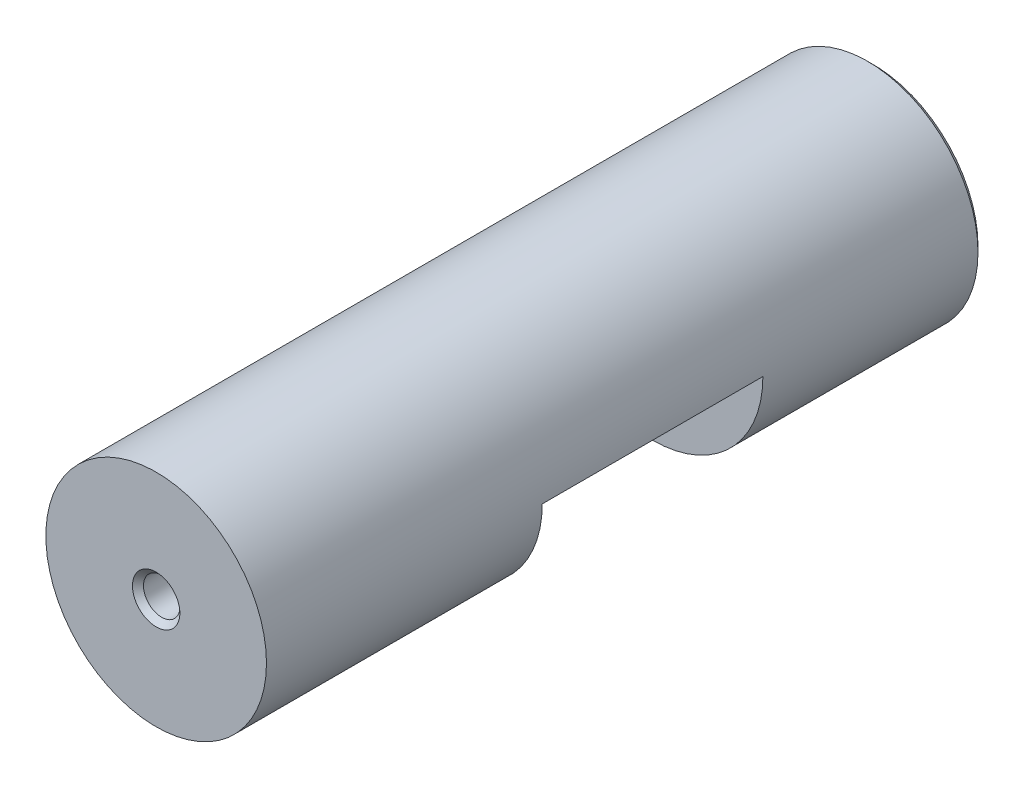
ISO-10303-21;
HEADER;
FILE_DESCRIPTION(('STEP AP214'),'2;1');
FILE_NAME('part.step','',(''),(''),'','','');
FILE_SCHEMA(('AUTOMOTIVE_DESIGN { 1 0 10303 214 1 1 1 1 }'));
ENDSEC;
DATA;
#1=APPLICATION_CONTEXT('core data for automotive mechanical design processes');
#2=APPLICATION_PROTOCOL_DEFINITION('international standard','automotive_design',2000,#1);
#3=PRODUCT_CONTEXT('',#1,'mechanical');
#4=PRODUCT('Part','Part','',(#3));
#5=PRODUCT_RELATED_PRODUCT_CATEGORY('part','',(#4));
#6=PRODUCT_DEFINITION_FORMATION('','',#4);
#7=PRODUCT_DEFINITION_CONTEXT('part definition',#1,'design');
#8=PRODUCT_DEFINITION('design','',#6,#7);
#9=PRODUCT_DEFINITION_SHAPE('','',#8);
#10=(LENGTH_UNIT() NAMED_UNIT(*) SI_UNIT(.MILLI.,.METRE.));
#11=(NAMED_UNIT(*) PLANE_ANGLE_UNIT() SI_UNIT($,.RADIAN.));
#12=(NAMED_UNIT(*) SI_UNIT($,.STERADIAN.) SOLID_ANGLE_UNIT());
#13=UNCERTAINTY_MEASURE_WITH_UNIT(LENGTH_MEASURE(1.E-05),#10,'distance_accuracy_value','');
#14=(GEOMETRIC_REPRESENTATION_CONTEXT(3) GLOBAL_UNCERTAINTY_ASSIGNED_CONTEXT((#13)) GLOBAL_UNIT_ASSIGNED_CONTEXT((#10,
#11,#12)) REPRESENTATION_CONTEXT('',''));
#15=CARTESIAN_POINT('',(0.,0.,0.));
#16=DIRECTION('',(0.,0.,1.));
#17=DIRECTION('',(1.,0.,0.));
#18=AXIS2_PLACEMENT_3D('',#15,#16,#17);
#19=CARTESIAN_POINT('',(0.,0.,65.));
#20=DIRECTION('',(0.,0.,-1.));
#21=DIRECTION('',(-1.,0.,0.));
#22=AXIS2_PLACEMENT_3D('',#19,#20,#21);
#23=CYLINDRICAL_SURFACE('',#22,10.);
#24=CARTESIAN_POINT('',(0.,0.,40.));
#25=DIRECTION('',(0.,0.,1.));
#26=DIRECTION('',(1.,0.,0.));
#27=AXIS2_PLACEMENT_3D('',#24,#25,#26);
#28=CIRCLE('',#27,10.);
#29=CARTESIAN_POINT('',(-10.,0.,40.));
#30=VERTEX_POINT('',#29);
#31=CARTESIAN_POINT('',(10.,0.,40.));
#32=VERTEX_POINT('',#31);
#33=EDGE_CURVE('E70',#30,#32,#28,.T.);
#34=ORIENTED_EDGE('',*,*,#33,.T.);
#35=DIRECTION('',(0.,0.,-1.));
#36=VECTOR('',#35,1.);
#37=CARTESIAN_POINT('',(10.,0.,65.));
#38=LINE('',#37,#36);
#39=CARTESIAN_POINT('',(10.,0.,20.));
#40=VERTEX_POINT('',#39);
#41=EDGE_CURVE('E11',#32,#40,#38,.T.);
#42=ORIENTED_EDGE('',*,*,#41,.T.);
#43=CARTESIAN_POINT('',(0.,0.,20.));
#44=DIRECTION('',(0.,0.,-1.));
#45=DIRECTION('',(-1.,0.,0.));
#46=AXIS2_PLACEMENT_3D('',#43,#44,#45);
#47=CIRCLE('',#46,10.);
#48=CARTESIAN_POINT('',(-10.,0.,20.));
#49=VERTEX_POINT('',#48);
#50=EDGE_CURVE('E45',#40,#49,#47,.T.);
#51=ORIENTED_EDGE('',*,*,#50,.T.);
#52=DIRECTION('',(0.,0.,-1.));
#53=VECTOR('',#52,1.);
#54=CARTESIAN_POINT('',(-10.,0.,65.));
#55=LINE('',#54,#53);
#56=EDGE_CURVE('E57',#49,#30,#55,.F.);
#57=ORIENTED_EDGE('',*,*,#56,.T.);
#58=EDGE_LOOP('',(#34,#42,#51,#57));
#59=FACE_BOUND('',#58,.T.);
#60=CARTESIAN_POINT('',(0.,0.,0.5));
#61=DIRECTION('',(0.,0.,1.));
#62=DIRECTION('',(1.,0.,0.));
#63=AXIS2_PLACEMENT_3D('',#60,#61,#62);
#64=CIRCLE('',#63,10.);
#65=CARTESIAN_POINT('',(10.,0.,0.5));
#66=VERTEX_POINT('',#65);
#67=EDGE_CURVE('E79',#66,#66,#64,.T.);
#68=ORIENTED_EDGE('',*,*,#67,.T.);
#69=EDGE_LOOP('',(#68));
#70=FACE_BOUND('',#69,.T.);
#71=CARTESIAN_POINT('',(0.,0.,65.));
#72=DIRECTION('',(0.,0.,1.));
#73=DIRECTION('',(1.,0.,0.));
#74=AXIS2_PLACEMENT_3D('',#71,#72,#73);
#75=CIRCLE('',#74,10.);
#76=CARTESIAN_POINT('',(10.,0.,65.));
#77=VERTEX_POINT('',#76);
#78=EDGE_CURVE('E94',#77,#77,#75,.T.);
#79=ORIENTED_EDGE('',*,*,#78,.F.);
#80=EDGE_LOOP('',(#79));
#81=FACE_BOUND('',#80,.T.);
#82=ADVANCED_FACE('F36',(#59,#70,#81),#23,.T.);
#83=CARTESIAN_POINT('',(0.,0.,65.));
#84=DIRECTION('',(0.,0.,1.));
#85=DIRECTION('',(1.,0.,0.));
#86=AXIS2_PLACEMENT_3D('',#83,#84,#85);
#87=PLANE('',#86);
#88=CARTESIAN_POINT('',(0.,0.,65.));
#89=DIRECTION('',(0.,0.,1.));
#90=DIRECTION('',(1.,0.,0.));
#91=AXIS2_PLACEMENT_3D('',#88,#89,#90);
#92=CIRCLE('',#91,2.14999999999999);
#93=CARTESIAN_POINT('',(2.14999999999999,0.,65.));
#94=VERTEX_POINT('',#93);
#95=EDGE_CURVE('E88',#94,#94,#92,.F.);
#96=ORIENTED_EDGE('',*,*,#95,.T.);
#97=EDGE_LOOP('',(#96));
#98=FACE_BOUND('',#97,.T.);
#99=ORIENTED_EDGE('',*,*,#78,.T.);
#100=EDGE_LOOP('',(#99));
#101=FACE_BOUND('',#100,.T.);
#102=ADVANCED_FACE('F116',(#98,#101),#87,.T.);
#103=CARTESIAN_POINT('',(0.,0.,0.));
#104=DIRECTION('',(0.,0.,1.));
#105=DIRECTION('',(1.,0.,0.));
#106=AXIS2_PLACEMENT_3D('',#103,#104,#105);
#107=PLANE('',#106);
#108=CARTESIAN_POINT('',(0.,0.,0.));
#109=DIRECTION('',(0.,0.,1.));
#110=DIRECTION('',(1.,0.,0.));
#111=AXIS2_PLACEMENT_3D('',#108,#109,#110);
#112=CIRCLE('',#111,9.5);
#113=CARTESIAN_POINT('',(9.5,0.,0.));
#114=VERTEX_POINT('',#113);
#115=EDGE_CURVE('E74',#114,#114,#112,.F.);
#116=ORIENTED_EDGE('',*,*,#115,.T.);
#117=EDGE_LOOP('',(#116));
#118=FACE_BOUND('',#117,.T.);
#119=CARTESIAN_POINT('',(0.,0.,0.));
#120=DIRECTION('',(0.,0.,1.));
#121=DIRECTION('',(1.,0.,0.));
#122=AXIS2_PLACEMENT_3D('',#119,#120,#121);
#123=CIRCLE('',#122,5.5);
#124=CARTESIAN_POINT('',(5.5,0.,0.));
#125=VERTEX_POINT('',#124);
#126=EDGE_CURVE('E82',#125,#125,#123,.T.);
#127=ORIENTED_EDGE('',*,*,#126,.T.);
#128=EDGE_LOOP('',(#127));
#129=FACE_BOUND('',#128,.T.);
#130=ADVANCED_FACE('F121',(#118,#129),#107,.F.);
#131=CARTESIAN_POINT('',(0.,0.,50.));
#132=DIRECTION('',(0.,0.,1.));
#133=DIRECTION('',(1.,0.,0.));
#134=AXIS2_PLACEMENT_3D('',#131,#132,#133);
#135=CYLINDRICAL_SURFACE('',#134,1.65);
#136=CARTESIAN_POINT('',(0.,0.,64.5));
#137=DIRECTION('',(0.,0.,1.));
#138=DIRECTION('',(1.,0.,0.));
#139=AXIS2_PLACEMENT_3D('',#136,#137,#138);
#140=CIRCLE('',#139,1.65);
#141=CARTESIAN_POINT('',(1.65,0.,64.5));
#142=VERTEX_POINT('',#141);
#143=EDGE_CURVE('E91',#142,#142,#140,.T.);
#144=ORIENTED_EDGE('',*,*,#143,.T.);
#145=EDGE_LOOP('',(#144));
#146=FACE_BOUND('',#145,.T.);
#147=CARTESIAN_POINT('',(0.,0.,50.));
#148=DIRECTION('',(0.,0.,1.));
#149=DIRECTION('',(1.,0.,0.));
#150=AXIS2_PLACEMENT_3D('',#147,#148,#149);
#151=CIRCLE('',#150,1.65);
#152=CARTESIAN_POINT('',(1.65,0.,50.));
#153=VERTEX_POINT('',#152);
#154=EDGE_CURVE('E97',#153,#153,#151,.T.);
#155=ORIENTED_EDGE('',*,*,#154,.F.);
#156=EDGE_LOOP('',(#155));
#157=FACE_BOUND('',#156,.T.);
#158=ADVANCED_FACE('F158',(#146,#157),#135,.F.);
#159=CARTESIAN_POINT('',(0.,0.,50.));
#160=DIRECTION('',(0.,0.,1.));
#161=DIRECTION('',(1.,0.,0.));
#162=AXIS2_PLACEMENT_3D('',#159,#160,#161);
#163=PLANE('',#162);
#164=ORIENTED_EDGE('',*,*,#154,.T.);
#165=EDGE_LOOP('',(#164));
#166=FACE_BOUND('',#165,.T.);
#167=ADVANCED_FACE('F133',(#166),#163,.T.);
#168=CARTESIAN_POINT('',(0.,0.,64.5));
#169=DIRECTION('',(0.,0.,1.));
#170=DIRECTION('',(1.,0.,0.));
#171=AXIS2_PLACEMENT_3D('',#168,#169,#170);
#172=CONICAL_SURFACE('',#171,1.65,0.785398163397454);
#173=ORIENTED_EDGE('',*,*,#95,.F.);
#174=EDGE_LOOP('',(#173));
#175=FACE_BOUND('',#174,.T.);
#176=ORIENTED_EDGE('',*,*,#143,.F.);
#177=EDGE_LOOP('',(#176));
#178=FACE_BOUND('',#177,.T.);
#179=ADVANCED_FACE('F127',(#175,#178),#172,.F.);
#180=CARTESIAN_POINT('',(0.,0.,15.));
#181=DIRECTION('',(0.,0.,-1.));
#182=DIRECTION('',(-1.,0.,0.));
#183=AXIS2_PLACEMENT_3D('',#180,#181,#182);
#184=CYLINDRICAL_SURFACE('',#183,5.);
#185=CARTESIAN_POINT('',(0.,0.,0.5));
#186=DIRECTION('',(0.,0.,1.));
#187=DIRECTION('',(1.,0.,0.));
#188=AXIS2_PLACEMENT_3D('',#185,#186,#187);
#189=CIRCLE('',#188,5.);
#190=CARTESIAN_POINT('',(5.,0.,0.5));
#191=VERTEX_POINT('',#190);
#192=EDGE_CURVE('E85',#191,#191,#189,.F.);
#193=ORIENTED_EDGE('',*,*,#192,.T.);
#194=EDGE_LOOP('',(#193));
#195=FACE_BOUND('',#194,.T.);
#196=CARTESIAN_POINT('',(0.,0.,15.));
#197=DIRECTION('',(0.,0.,-1.));
#198=DIRECTION('',(-1.,0.,0.));
#199=AXIS2_PLACEMENT_3D('',#196,#197,#198);
#200=CIRCLE('',#199,5.);
#201=CARTESIAN_POINT('',(-5.,0.,15.));
#202=VERTEX_POINT('',#201);
#203=EDGE_CURVE('E100',#202,#202,#200,.T.);
#204=ORIENTED_EDGE('',*,*,#203,.F.);
#205=EDGE_LOOP('',(#204));
#206=FACE_BOUND('',#205,.T.);
#207=ADVANCED_FACE('F132',(#195,#206),#184,.F.);
#208=CARTESIAN_POINT('',(0.,0.,15.));
#209=DIRECTION('',(0.,0.,-1.));
#210=DIRECTION('',(-1.,0.,0.));
#211=AXIS2_PLACEMENT_3D('',#208,#209,#210);
#212=PLANE('',#211);
#213=ORIENTED_EDGE('',*,*,#203,.T.);
#214=EDGE_LOOP('',(#213));
#215=FACE_BOUND('',#214,.T.);
#216=ADVANCED_FACE('F138',(#215),#212,.T.);
#217=CARTESIAN_POINT('',(0.,0.,0.5));
#218=DIRECTION('',(0.,0.,-1.));
#219=DIRECTION('',(-1.,0.,0.));
#220=AXIS2_PLACEMENT_3D('',#217,#218,#219);
#221=CONICAL_SURFACE('',#220,5.,0.785398163397446);
#222=ORIENTED_EDGE('',*,*,#126,.F.);
#223=EDGE_LOOP('',(#222));
#224=FACE_BOUND('',#223,.T.);
#225=ORIENTED_EDGE('',*,*,#192,.F.);
#226=EDGE_LOOP('',(#225));
#227=FACE_BOUND('',#226,.T.);
#228=ADVANCED_FACE('F112',(#224,#227),#221,.F.);
#229=CARTESIAN_POINT('',(0.,0.,0.5));
#230=DIRECTION('',(0.,0.,1.));
#231=DIRECTION('',(1.,0.,0.));
#232=AXIS2_PLACEMENT_3D('',#229,#230,#231);
#233=CONICAL_SURFACE('',#232,10.,0.785398163397445);
#234=ORIENTED_EDGE('',*,*,#115,.F.);
#235=EDGE_LOOP('',(#234));
#236=FACE_BOUND('',#235,.T.);
#237=ORIENTED_EDGE('',*,*,#67,.F.);
#238=EDGE_LOOP('',(#237));
#239=FACE_BOUND('',#238,.T.);
#240=ADVANCED_FACE('F39',(#236,#239),#233,.T.);
#241=CARTESIAN_POINT('',(-12.1982224350233,-13.,20.));
#242=DIRECTION('',(0.,0.,-1.));
#243=DIRECTION('',(-1.,0.,0.));
#244=AXIS2_PLACEMENT_3D('',#241,#242,#243);
#245=PLANE('',#244);
#246=DIRECTION('',(-1.,0.,0.));
#247=VECTOR('',#246,1.);
#248=CARTESIAN_POINT('',(-12.1982224350233,0.,20.));
#249=LINE('',#248,#247);
#250=EDGE_CURVE('E64',#40,#49,#249,.T.);
#251=ORIENTED_EDGE('',*,*,#250,.T.);
#252=ORIENTED_EDGE('',*,*,#50,.F.);
#253=EDGE_LOOP('',(#251,#252));
#254=FACE_BOUND('',#253,.T.);
#255=ADVANCED_FACE('F104',(#254),#245,.F.);
#256=CARTESIAN_POINT('',(-12.1982224350233,-13.,40.));
#257=DIRECTION('',(0.,0.,1.));
#258=DIRECTION('',(1.,0.,0.));
#259=AXIS2_PLACEMENT_3D('',#256,#257,#258);
#260=PLANE('',#259);
#261=DIRECTION('',(1.,0.,0.));
#262=VECTOR('',#261,1.);
#263=CARTESIAN_POINT('',(-12.1982224350233,0.,40.));
#264=LINE('',#263,#262);
#265=EDGE_CURVE('E52',#30,#32,#264,.T.);
#266=ORIENTED_EDGE('',*,*,#265,.T.);
#267=ORIENTED_EDGE('',*,*,#33,.F.);
#268=EDGE_LOOP('',(#266,#267));
#269=FACE_BOUND('',#268,.T.);
#270=ADVANCED_FACE('F69',(#269),#260,.F.);
#271=CARTESIAN_POINT('',(0.,0.,0.));
#272=DIRECTION('',(0.,1.,0.));
#273=DIRECTION('',(0.,0.,1.));
#274=AXIS2_PLACEMENT_3D('',#271,#272,#273);
#275=PLANE('',#274);
#276=ORIENTED_EDGE('',*,*,#265,.F.);
#277=ORIENTED_EDGE('',*,*,#56,.F.);
#278=ORIENTED_EDGE('',*,*,#250,.F.);
#279=ORIENTED_EDGE('',*,*,#41,.F.);
#280=EDGE_LOOP('',(#276,#277,#278,#279));
#281=FACE_BOUND('',#280,.T.);
#282=ADVANCED_FACE('F63',(#281),#275,.F.);
#283=CLOSED_SHELL('',(#82,#102,#130,#158,#167,#179,#207,#216,#228,#240,#255,#270,#282));
#284=MANIFOLD_SOLID_BREP('B2',#283);
#285=ADVANCED_BREP_SHAPE_REPRESENTATION('',(#18,#284),#14);
#286=SHAPE_DEFINITION_REPRESENTATION(#9,#285);
ENDSEC;
END-ISO-10303-21;
